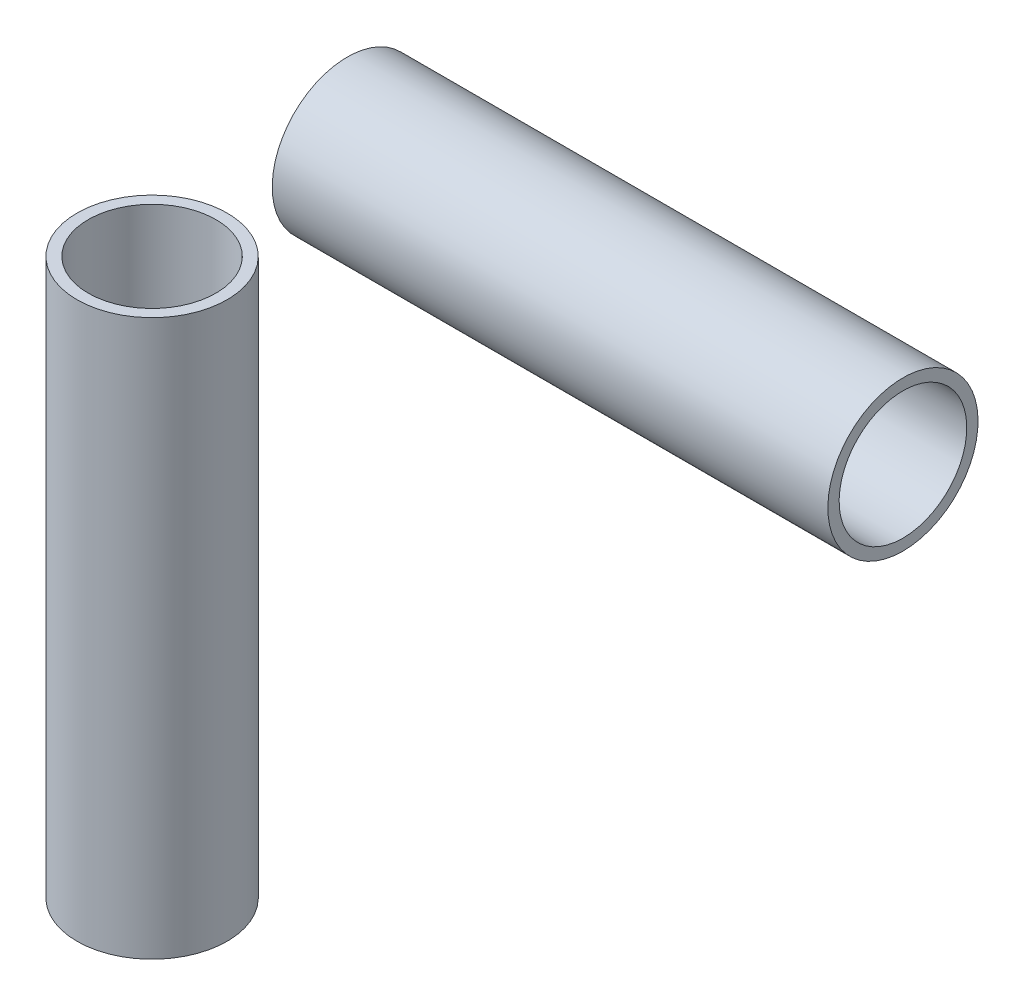
ISO-10303-21;
HEADER;
FILE_DESCRIPTION(('STEP AP214'),'2;1');
FILE_NAME('part.step','',(''),(''),'','','');
FILE_SCHEMA(('AUTOMOTIVE_DESIGN { 1 0 10303 214 1 1 1 1 }'));
ENDSEC;
DATA;
#1=APPLICATION_CONTEXT('core data for automotive mechanical design processes');
#2=APPLICATION_PROTOCOL_DEFINITION('international standard','automotive_design',2000,#1);
#3=PRODUCT_CONTEXT('',#1,'mechanical');
#4=PRODUCT('Part','Part','',(#3));
#5=PRODUCT_RELATED_PRODUCT_CATEGORY('part','',(#4));
#6=PRODUCT_DEFINITION_FORMATION('','',#4);
#7=PRODUCT_DEFINITION_CONTEXT('part definition',#1,'design');
#8=PRODUCT_DEFINITION('design','',#6,#7);
#9=PRODUCT_DEFINITION_SHAPE('','',#8);
#10=(LENGTH_UNIT() NAMED_UNIT(*) SI_UNIT(.MILLI.,.METRE.));
#11=(NAMED_UNIT(*) PLANE_ANGLE_UNIT() SI_UNIT($,.RADIAN.));
#12=(NAMED_UNIT(*) SI_UNIT($,.STERADIAN.) SOLID_ANGLE_UNIT());
#13=UNCERTAINTY_MEASURE_WITH_UNIT(LENGTH_MEASURE(1.E-05),#10,'distance_accuracy_value','');
#14=(GEOMETRIC_REPRESENTATION_CONTEXT(3) GLOBAL_UNCERTAINTY_ASSIGNED_CONTEXT((#13)) GLOBAL_UNIT_ASSIGNED_CONTEXT((#10,
#11,#12)) REPRESENTATION_CONTEXT('',''));
#15=CARTESIAN_POINT('',(0.,0.,0.));
#16=DIRECTION('',(0.,0.,1.));
#17=DIRECTION('',(1.,0.,0.));
#18=AXIS2_PLACEMENT_3D('',#15,#16,#17);
#19=CARTESIAN_POINT('',(100.,100.,0.));
#20=DIRECTION('',(-1.,0.,0.));
#21=DIRECTION('',(0.,0.,1.));
#22=AXIS2_PLACEMENT_3D('',#19,#20,#21);
#23=CYLINDRICAL_SURFACE('',#22,8.5);
#24=CARTESIAN_POINT('',(100.,100.,0.));
#25=DIRECTION('',(1.,0.,0.));
#26=DIRECTION('',(0.,-1.,0.));
#27=AXIS2_PLACEMENT_3D('',#24,#25,#26);
#28=CIRCLE('',#27,8.5);
#29=CARTESIAN_POINT('',(100.,91.5,0.));
#30=VERTEX_POINT('',#29);
#31=EDGE_CURVE('E53',#30,#30,#28,.T.);
#32=ORIENTED_EDGE('',*,*,#31,.T.);
#33=EDGE_LOOP('',(#32));
#34=FACE_BOUND('',#33,.T.);
#35=CARTESIAN_POINT('',(26.,100.,0.));
#36=DIRECTION('',(1.,0.,0.));
#37=DIRECTION('',(0.,-1.,0.));
#38=AXIS2_PLACEMENT_3D('',#35,#36,#37);
#39=CIRCLE('',#38,8.5);
#40=CARTESIAN_POINT('',(26.,91.5,0.));
#41=VERTEX_POINT('',#40);
#42=EDGE_CURVE('E59',#41,#41,#39,.T.);
#43=ORIENTED_EDGE('',*,*,#42,.F.);
#44=EDGE_LOOP('',(#43));
#45=FACE_BOUND('',#44,.T.);
#46=ADVANCED_FACE('F46',(#34,#45),#23,.F.);
#47=CARTESIAN_POINT('',(100.,100.,0.));
#48=DIRECTION('',(-1.,0.,0.));
#49=DIRECTION('',(0.,0.,1.));
#50=AXIS2_PLACEMENT_3D('',#47,#48,#49);
#51=CYLINDRICAL_SURFACE('',#50,10.);
#52=CARTESIAN_POINT('',(100.,100.,0.));
#53=DIRECTION('',(1.,0.,0.));
#54=DIRECTION('',(0.,-1.,0.));
#55=AXIS2_PLACEMENT_3D('',#52,#53,#54);
#56=CIRCLE('',#55,10.);
#57=CARTESIAN_POINT('',(100.,90.,0.));
#58=VERTEX_POINT('',#57);
#59=EDGE_CURVE('E12',#58,#58,#56,.T.);
#60=ORIENTED_EDGE('',*,*,#59,.F.);
#61=EDGE_LOOP('',(#60));
#62=FACE_BOUND('',#61,.T.);
#63=CARTESIAN_POINT('',(26.,100.,0.));
#64=DIRECTION('',(1.,0.,0.));
#65=DIRECTION('',(0.,-1.,0.));
#66=AXIS2_PLACEMENT_3D('',#63,#64,#65);
#67=CIRCLE('',#66,10.);
#68=CARTESIAN_POINT('',(26.,90.,0.));
#69=VERTEX_POINT('',#68);
#70=EDGE_CURVE('E49',#69,#69,#67,.T.);
#71=ORIENTED_EDGE('',*,*,#70,.T.);
#72=EDGE_LOOP('',(#71));
#73=FACE_BOUND('',#72,.T.);
#74=ADVANCED_FACE('F66',(#62,#73),#51,.T.);
#75=CARTESIAN_POINT('',(100.,100.,0.));
#76=DIRECTION('',(1.,0.,0.));
#77=DIRECTION('',(0.,-1.,0.));
#78=AXIS2_PLACEMENT_3D('',#75,#76,#77);
#79=PLANE('',#78);
#80=ORIENTED_EDGE('',*,*,#31,.F.);
#81=EDGE_LOOP('',(#80));
#82=FACE_BOUND('',#81,.T.);
#83=ORIENTED_EDGE('',*,*,#59,.T.);
#84=EDGE_LOOP('',(#83));
#85=FACE_BOUND('',#84,.T.);
#86=ADVANCED_FACE('F70',(#82,#85),#79,.T.);
#87=CARTESIAN_POINT('',(26.,100.,0.));
#88=DIRECTION('',(1.,0.,0.));
#89=DIRECTION('',(0.,-1.,0.));
#90=AXIS2_PLACEMENT_3D('',#87,#88,#89);
#91=PLANE('',#90);
#92=ORIENTED_EDGE('',*,*,#42,.T.);
#93=EDGE_LOOP('',(#92));
#94=FACE_BOUND('',#93,.T.);
#95=ORIENTED_EDGE('',*,*,#70,.F.);
#96=EDGE_LOOP('',(#95));
#97=FACE_BOUND('',#96,.T.);
#98=ADVANCED_FACE('F68',(#94,#97),#91,.F.);
#99=CLOSED_SHELL('',(#46,#74,#86,#98));
#100=MANIFOLD_SOLID_BREP('B2',#99);
#101=CARTESIAN_POINT('',(0.,74.,0.));
#102=DIRECTION('',(0.,-1.,0.));
#103=DIRECTION('',(0.,0.,-1.));
#104=AXIS2_PLACEMENT_3D('',#101,#102,#103);
#105=CYLINDRICAL_SURFACE('',#104,8.5);
#106=CARTESIAN_POINT('',(0.,74.,0.));
#107=DIRECTION('',(0.,1.,0.));
#108=DIRECTION('',(0.,0.,1.));
#109=AXIS2_PLACEMENT_3D('',#106,#107,#108);
#110=CIRCLE('',#109,8.5);
#111=CARTESIAN_POINT('',(0.,74.,8.5));
#112=VERTEX_POINT('',#111);
#113=EDGE_CURVE('E123',#112,#112,#110,.T.);
#114=ORIENTED_EDGE('',*,*,#113,.T.);
#115=EDGE_LOOP('',(#114));
#116=FACE_BOUND('',#115,.T.);
#117=CARTESIAN_POINT('',(0.,0.,0.));
#118=DIRECTION('',(0.,1.,0.));
#119=DIRECTION('',(0.,0.,1.));
#120=AXIS2_PLACEMENT_3D('',#117,#118,#119);
#121=CIRCLE('',#120,8.5);
#122=CARTESIAN_POINT('',(0.,0.,8.5));
#123=VERTEX_POINT('',#122);
#124=EDGE_CURVE('E129',#123,#123,#121,.T.);
#125=ORIENTED_EDGE('',*,*,#124,.F.);
#126=EDGE_LOOP('',(#125));
#127=FACE_BOUND('',#126,.T.);
#128=ADVANCED_FACE('F116',(#116,#127),#105,.F.);
#129=CARTESIAN_POINT('',(0.,74.,0.));
#130=DIRECTION('',(0.,-1.,0.));
#131=DIRECTION('',(0.,0.,-1.));
#132=AXIS2_PLACEMENT_3D('',#129,#130,#131);
#133=CYLINDRICAL_SURFACE('',#132,10.);
#134=CARTESIAN_POINT('',(0.,74.,0.));
#135=DIRECTION('',(0.,1.,0.));
#136=DIRECTION('',(0.,0.,1.));
#137=AXIS2_PLACEMENT_3D('',#134,#135,#136);
#138=CIRCLE('',#137,10.);
#139=CARTESIAN_POINT('',(0.,74.,10.));
#140=VERTEX_POINT('',#139);
#141=EDGE_CURVE('E45',#140,#140,#138,.T.);
#142=ORIENTED_EDGE('',*,*,#141,.F.);
#143=EDGE_LOOP('',(#142));
#144=FACE_BOUND('',#143,.T.);
#145=CARTESIAN_POINT('',(0.,0.,0.));
#146=DIRECTION('',(0.,1.,0.));
#147=DIRECTION('',(0.,0.,1.));
#148=AXIS2_PLACEMENT_3D('',#145,#146,#147);
#149=CIRCLE('',#148,10.);
#150=CARTESIAN_POINT('',(0.,0.,10.));
#151=VERTEX_POINT('',#150);
#152=EDGE_CURVE('E119',#151,#151,#149,.T.);
#153=ORIENTED_EDGE('',*,*,#152,.T.);
#154=EDGE_LOOP('',(#153));
#155=FACE_BOUND('',#154,.T.);
#156=ADVANCED_FACE('F136',(#144,#155),#133,.T.);
#157=CARTESIAN_POINT('',(0.,74.,0.));
#158=DIRECTION('',(0.,1.,0.));
#159=DIRECTION('',(0.,0.,1.));
#160=AXIS2_PLACEMENT_3D('',#157,#158,#159);
#161=PLANE('',#160);
#162=ORIENTED_EDGE('',*,*,#113,.F.);
#163=EDGE_LOOP('',(#162));
#164=FACE_BOUND('',#163,.T.);
#165=ORIENTED_EDGE('',*,*,#141,.T.);
#166=EDGE_LOOP('',(#165));
#167=FACE_BOUND('',#166,.T.);
#168=ADVANCED_FACE('F140',(#164,#167),#161,.T.);
#169=CARTESIAN_POINT('',(0.,0.,0.));
#170=DIRECTION('',(0.,1.,0.));
#171=DIRECTION('',(0.,0.,1.));
#172=AXIS2_PLACEMENT_3D('',#169,#170,#171);
#173=PLANE('',#172);
#174=ORIENTED_EDGE('',*,*,#124,.T.);
#175=EDGE_LOOP('',(#174));
#176=FACE_BOUND('',#175,.T.);
#177=ORIENTED_EDGE('',*,*,#152,.F.);
#178=EDGE_LOOP('',(#177));
#179=FACE_BOUND('',#178,.T.);
#180=ADVANCED_FACE('F138',(#176,#179),#173,.F.);
#181=CLOSED_SHELL('',(#128,#156,#168,#180));
#182=MANIFOLD_SOLID_BREP('B7',#181);
#183=ADVANCED_BREP_SHAPE_REPRESENTATION('',(#18,#100,#182),#14);
#184=SHAPE_DEFINITION_REPRESENTATION(#9,#183);
ENDSEC;
END-ISO-10303-21;
